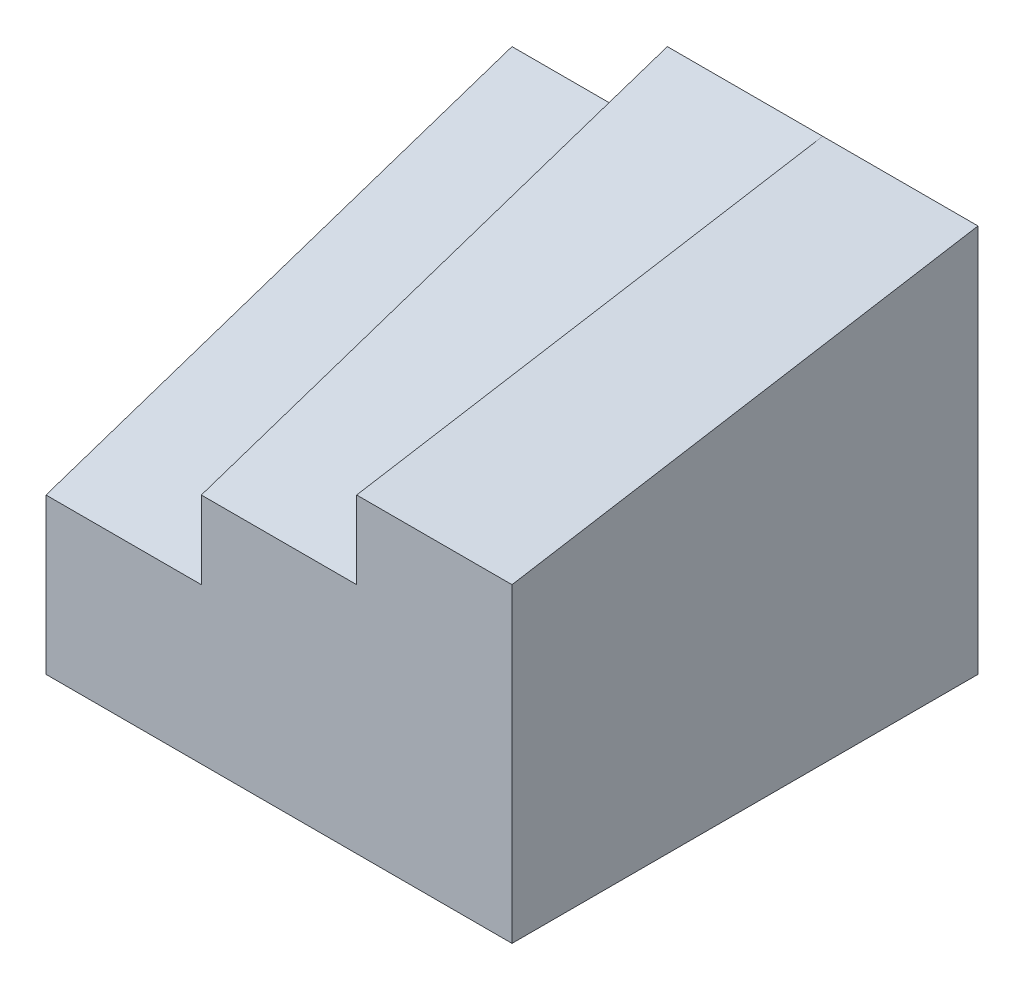
ISO-10303-21;
HEADER;
FILE_DESCRIPTION(('STEP AP214'),'2;1');
FILE_NAME('part.step','',(''),(''),'','','');
FILE_SCHEMA(('AUTOMOTIVE_DESIGN { 1 0 10303 214 1 1 1 1 }'));
ENDSEC;
DATA;
#1=APPLICATION_CONTEXT('core data for automotive mechanical design processes');
#2=APPLICATION_PROTOCOL_DEFINITION('international standard','automotive_design',2000,#1);
#3=PRODUCT_CONTEXT('',#1,'mechanical');
#4=PRODUCT('Part','Part','',(#3));
#5=PRODUCT_RELATED_PRODUCT_CATEGORY('part','',(#4));
#6=PRODUCT_DEFINITION_FORMATION('','',#4);
#7=PRODUCT_DEFINITION_CONTEXT('part definition',#1,'design');
#8=PRODUCT_DEFINITION('design','',#6,#7);
#9=PRODUCT_DEFINITION_SHAPE('','',#8);
#10=(LENGTH_UNIT() NAMED_UNIT(*) SI_UNIT(.MILLI.,.METRE.));
#11=(NAMED_UNIT(*) PLANE_ANGLE_UNIT() SI_UNIT($,.RADIAN.));
#12=(NAMED_UNIT(*) SI_UNIT($,.STERADIAN.) SOLID_ANGLE_UNIT());
#13=UNCERTAINTY_MEASURE_WITH_UNIT(LENGTH_MEASURE(1.E-05),#10,'distance_accuracy_value','');
#14=(GEOMETRIC_REPRESENTATION_CONTEXT(3) GLOBAL_UNCERTAINTY_ASSIGNED_CONTEXT((#13)) GLOBAL_UNIT_ASSIGNED_CONTEXT((#10,
#11,#12)) REPRESENTATION_CONTEXT('',''));
#15=CARTESIAN_POINT('',(0.,0.,0.));
#16=DIRECTION('',(0.,0.,1.));
#17=DIRECTION('',(1.,0.,0.));
#18=AXIS2_PLACEMENT_3D('',#15,#16,#17);
#19=CARTESIAN_POINT('',(-3.,5.,-3.));
#20=DIRECTION('',(0.,0.,1.));
#21=DIRECTION('',(1.,0.,0.));
#22=AXIS2_PLACEMENT_3D('',#19,#20,#21);
#23=PLANE('',#22);
#24=DIRECTION('',(-1.,0.,0.));
#25=VECTOR('',#24,1.);
#26=CARTESIAN_POINT('',(-1.,4.,-3.));
#27=LINE('',#26,#25);
#28=CARTESIAN_POINT('',(-1.,4.,-3.));
#29=VERTEX_POINT('',#28);
#30=CARTESIAN_POINT('',(-3.,4.,-3.));
#31=VERTEX_POINT('',#30);
#32=EDGE_CURVE('E183',#29,#31,#27,.T.);
#33=ORIENTED_EDGE('',*,*,#32,.F.);
#34=DIRECTION('',(0.,-1.,0.));
#35=VECTOR('',#34,1.);
#36=CARTESIAN_POINT('',(-1.,0.,-3.));
#37=LINE('',#36,#35);
#38=CARTESIAN_POINT('',(-1.,5.,-3.));
#39=VERTEX_POINT('',#38);
#40=EDGE_CURVE('E184',#39,#29,#37,.T.);
#41=ORIENTED_EDGE('',*,*,#40,.F.);
#42=DIRECTION('',(1.,0.,0.));
#43=VECTOR('',#42,1.);
#44=CARTESIAN_POINT('',(-1.,5.,-3.));
#45=LINE('',#44,#43);
#46=CARTESIAN_POINT('',(1.,5.,-3.));
#47=VERTEX_POINT('',#46);
#48=EDGE_CURVE('E131',#39,#47,#45,.T.);
#49=ORIENTED_EDGE('',*,*,#48,.T.);
#50=DIRECTION('',(-1.,0.,0.));
#51=VECTOR('',#50,1.);
#52=CARTESIAN_POINT('',(-3.,5.,-3.));
#53=LINE('',#52,#51);
#54=CARTESIAN_POINT('',(3.,5.,-3.));
#55=VERTEX_POINT('',#54);
#56=EDGE_CURVE('E118',#55,#47,#53,.T.);
#57=ORIENTED_EDGE('',*,*,#56,.F.);
#58=DIRECTION('',(0.,-1.,0.));
#59=VECTOR('',#58,1.);
#60=CARTESIAN_POINT('',(3.,5.,-3.));
#61=LINE('',#60,#59);
#62=CARTESIAN_POINT('',(3.,0.,-3.));
#63=VERTEX_POINT('',#62);
#64=EDGE_CURVE('E11',#55,#63,#61,.T.);
#65=ORIENTED_EDGE('',*,*,#64,.T.);
#66=DIRECTION('',(-1.,0.,0.));
#67=VECTOR('',#66,1.);
#68=CARTESIAN_POINT('',(-3.,0.,-3.));
#69=LINE('',#68,#67);
#70=CARTESIAN_POINT('',(1.,0.,-3.));
#71=VERTEX_POINT('',#70);
#72=EDGE_CURVE('E142',#63,#71,#69,.T.);
#73=ORIENTED_EDGE('',*,*,#72,.T.);
#74=DIRECTION('',(0.,1.,0.));
#75=VECTOR('',#74,1.);
#76=CARTESIAN_POINT('',(1.,1.,-3.));
#77=LINE('',#76,#75);
#78=CARTESIAN_POINT('',(1.,1.,-3.));
#79=VERTEX_POINT('',#78);
#80=EDGE_CURVE('E48',#71,#79,#77,.T.);
#81=ORIENTED_EDGE('',*,*,#80,.T.);
#82=DIRECTION('',(1.,0.,0.));
#83=VECTOR('',#82,1.);
#84=CARTESIAN_POINT('',(-1.,1.,-3.));
#85=LINE('',#84,#83);
#86=CARTESIAN_POINT('',(-1.,1.,-3.));
#87=VERTEX_POINT('',#86);
#88=EDGE_CURVE('E145',#87,#79,#85,.T.);
#89=ORIENTED_EDGE('',*,*,#88,.F.);
#90=DIRECTION('',(0.,1.,0.));
#91=VECTOR('',#90,1.);
#92=CARTESIAN_POINT('',(-1.,1.,-3.));
#93=LINE('',#92,#91);
#94=CARTESIAN_POINT('',(-1.,0.,-3.));
#95=VERTEX_POINT('',#94);
#96=EDGE_CURVE('E169',#95,#87,#93,.T.);
#97=ORIENTED_EDGE('',*,*,#96,.F.);
#98=CARTESIAN_POINT('',(-3.,0.,-3.));
#99=VERTEX_POINT('',#98);
#100=EDGE_CURVE('E138',#95,#99,#69,.T.);
#101=ORIENTED_EDGE('',*,*,#100,.T.);
#102=DIRECTION('',(0.,-1.,0.));
#103=VECTOR('',#102,1.);
#104=CARTESIAN_POINT('',(-3.,5.,-3.));
#105=LINE('',#104,#103);
#106=EDGE_CURVE('E41',#31,#99,#105,.T.);
#107=ORIENTED_EDGE('',*,*,#106,.F.);
#108=EDGE_LOOP('',(#33,#41,#49,#57,#65,#73,#81,#89,#97,#101,#107));
#109=FACE_BOUND('',#108,.T.);
#110=ADVANCED_FACE('F33',(#109),#23,.F.);
#111=CARTESIAN_POINT('',(-3.,5.,3.));
#112=DIRECTION('',(0.,0.,-1.));
#113=DIRECTION('',(-1.,0.,0.));
#114=AXIS2_PLACEMENT_3D('',#111,#112,#113);
#115=PLANE('',#114);
#116=DIRECTION('',(0.,-1.,0.));
#117=VECTOR('',#116,1.);
#118=CARTESIAN_POINT('',(3.,5.,3.));
#119=LINE('',#118,#117);
#120=CARTESIAN_POINT('',(3.,4.,3.));
#121=VERTEX_POINT('',#120);
#122=CARTESIAN_POINT('',(3.,0.,3.));
#123=VERTEX_POINT('',#122);
#124=EDGE_CURVE('E56',#121,#123,#119,.T.);
#125=ORIENTED_EDGE('',*,*,#124,.F.);
#126=DIRECTION('',(-1.,0.,0.));
#127=VECTOR('',#126,1.);
#128=CARTESIAN_POINT('',(3.,4.,3.));
#129=LINE('',#128,#127);
#130=CARTESIAN_POINT('',(1.,4.,3.));
#131=VERTEX_POINT('',#130);
#132=EDGE_CURVE('E121',#121,#131,#129,.T.);
#133=ORIENTED_EDGE('',*,*,#132,.T.);
#134=DIRECTION('',(0.,-1.,0.));
#135=VECTOR('',#134,1.);
#136=CARTESIAN_POINT('',(1.,3.,3.));
#137=LINE('',#136,#135);
#138=CARTESIAN_POINT('',(1.,3.,3.));
#139=VERTEX_POINT('',#138);
#140=EDGE_CURVE('E186',#131,#139,#137,.T.);
#141=ORIENTED_EDGE('',*,*,#140,.T.);
#142=DIRECTION('',(1.,0.,0.));
#143=VECTOR('',#142,1.);
#144=CARTESIAN_POINT('',(-1.,3.,3.));
#145=LINE('',#144,#143);
#146=CARTESIAN_POINT('',(-1.,3.,3.));
#147=VERTEX_POINT('',#146);
#148=EDGE_CURVE('E205',#147,#139,#145,.T.);
#149=ORIENTED_EDGE('',*,*,#148,.F.);
#150=DIRECTION('',(0.,1.,0.));
#151=VECTOR('',#150,1.);
#152=CARTESIAN_POINT('',(-1.,0.,3.));
#153=LINE('',#152,#151);
#154=CARTESIAN_POINT('',(-1.,2.,3.));
#155=VERTEX_POINT('',#154);
#156=EDGE_CURVE('E180',#155,#147,#153,.T.);
#157=ORIENTED_EDGE('',*,*,#156,.F.);
#158=DIRECTION('',(-1.,0.,0.));
#159=VECTOR('',#158,1.);
#160=CARTESIAN_POINT('',(-1.,2.,3.));
#161=LINE('',#160,#159);
#162=CARTESIAN_POINT('',(-3.,2.,3.));
#163=VERTEX_POINT('',#162);
#164=EDGE_CURVE('E178',#155,#163,#161,.T.);
#165=ORIENTED_EDGE('',*,*,#164,.T.);
#166=DIRECTION('',(0.,-1.,0.));
#167=VECTOR('',#166,1.);
#168=CARTESIAN_POINT('',(-3.,5.,3.));
#169=LINE('',#168,#167);
#170=CARTESIAN_POINT('',(-3.,0.,3.));
#171=VERTEX_POINT('',#170);
#172=EDGE_CURVE('E156',#163,#171,#169,.T.);
#173=ORIENTED_EDGE('',*,*,#172,.T.);
#174=DIRECTION('',(1.,0.,0.));
#175=VECTOR('',#174,1.);
#176=CARTESIAN_POINT('',(-3.,0.,3.));
#177=LINE('',#176,#175);
#178=CARTESIAN_POINT('',(-1.,0.,3.));
#179=VERTEX_POINT('',#178);
#180=EDGE_CURVE('E132',#171,#179,#177,.T.);
#181=ORIENTED_EDGE('',*,*,#180,.T.);
#182=DIRECTION('',(1.,0.,0.));
#183=VECTOR('',#182,1.);
#184=CARTESIAN_POINT('',(-1.,0.,3.));
#185=LINE('',#184,#183);
#186=CARTESIAN_POINT('',(1.,0.,3.));
#187=VERTEX_POINT('',#186);
#188=EDGE_CURVE('E139',#179,#187,#185,.T.);
#189=ORIENTED_EDGE('',*,*,#188,.T.);
#190=EDGE_CURVE('E152',#187,#123,#177,.T.);
#191=ORIENTED_EDGE('',*,*,#190,.T.);
#192=EDGE_LOOP('',(#125,#133,#141,#149,#157,#165,#173,#181,#189,#191));
#193=FACE_BOUND('',#192,.T.);
#194=ADVANCED_FACE('F175',(#193),#115,.F.);
#195=CARTESIAN_POINT('',(-3.,5.,3.));
#196=DIRECTION('',(1.,0.,0.));
#197=DIRECTION('',(0.,0.,-1.));
#198=AXIS2_PLACEMENT_3D('',#195,#196,#197);
#199=PLANE('',#198);
#200=DIRECTION('',(0.,0.316227766016838,-0.948683298050514));
#201=VECTOR('',#200,1.);
#202=CARTESIAN_POINT('',(-3.,2.7,0.9));
#203=LINE('',#202,#201);
#204=EDGE_CURVE('E164',#163,#31,#203,.T.);
#205=ORIENTED_EDGE('',*,*,#204,.T.);
#206=ORIENTED_EDGE('',*,*,#106,.T.);
#207=DIRECTION('',(0.,0.,1.));
#208=VECTOR('',#207,1.);
#209=CARTESIAN_POINT('',(-3.,0.,3.));
#210=LINE('',#209,#208);
#211=EDGE_CURVE('E149',#99,#171,#210,.T.);
#212=ORIENTED_EDGE('',*,*,#211,.T.);
#213=ORIENTED_EDGE('',*,*,#172,.F.);
#214=EDGE_LOOP('',(#205,#206,#212,#213));
#215=FACE_BOUND('',#214,.T.);
#216=ADVANCED_FACE('F160',(#215),#199,.F.);
#217=CARTESIAN_POINT('',(0.,0.,0.));
#218=DIRECTION('',(0.,-1.,0.));
#219=DIRECTION('',(0.,0.,-1.));
#220=AXIS2_PLACEMENT_3D('',#217,#218,#219);
#221=PLANE('',#220);
#222=ORIENTED_EDGE('',*,*,#100,.F.);
#223=DIRECTION('',(0.,0.,-1.));
#224=VECTOR('',#223,1.);
#225=CARTESIAN_POINT('',(-1.,0.,3.));
#226=LINE('',#225,#224);
#227=EDGE_CURVE('E173',#179,#95,#226,.T.);
#228=ORIENTED_EDGE('',*,*,#227,.F.);
#229=ORIENTED_EDGE('',*,*,#180,.F.);
#230=ORIENTED_EDGE('',*,*,#211,.F.);
#231=EDGE_LOOP('',(#222,#228,#229,#230));
#232=FACE_BOUND('',#231,.T.);
#233=ADVANCED_FACE('F172',(#232),#221,.T.);
#234=CARTESIAN_POINT('',(3.,5.,3.));
#235=DIRECTION('',(-1.,0.,0.));
#236=DIRECTION('',(0.,0.,1.));
#237=AXIS2_PLACEMENT_3D('',#234,#235,#236);
#238=PLANE('',#237);
#239=ORIENTED_EDGE('',*,*,#64,.F.);
#240=DIRECTION('',(0.,-0.164398987305357,0.986393923832144));
#241=VECTOR('',#240,1.);
#242=CARTESIAN_POINT('',(3.,4.37837837837838,0.72972972972973));
#243=LINE('',#242,#241);
#244=EDGE_CURVE('E115',#55,#121,#243,.T.);
#245=ORIENTED_EDGE('',*,*,#244,.T.);
#246=ORIENTED_EDGE('',*,*,#124,.T.);
#247=DIRECTION('',(0.,0.,-1.));
#248=VECTOR('',#247,1.);
#249=CARTESIAN_POINT('',(3.,0.,3.));
#250=LINE('',#249,#248);
#251=EDGE_CURVE('E135',#123,#63,#250,.T.);
#252=ORIENTED_EDGE('',*,*,#251,.T.);
#253=EDGE_LOOP('',(#239,#245,#246,#252));
#254=FACE_BOUND('',#253,.T.);
#255=ADVANCED_FACE('F35',(#254),#238,.F.);
#256=DIRECTION('',(0.,0.,-1.));
#257=VECTOR('',#256,1.);
#258=CARTESIAN_POINT('',(1.,0.,3.));
#259=LINE('',#258,#257);
#260=EDGE_CURVE('E194',#187,#71,#259,.T.);
#261=ORIENTED_EDGE('',*,*,#260,.T.);
#262=ORIENTED_EDGE('',*,*,#72,.F.);
#263=ORIENTED_EDGE('',*,*,#251,.F.);
#264=ORIENTED_EDGE('',*,*,#190,.F.);
#265=EDGE_LOOP('',(#261,#262,#263,#264));
#266=FACE_BOUND('',#265,.T.);
#267=ADVANCED_FACE('F243',(#266),#221,.T.);
#268=CARTESIAN_POINT('',(-1.,0.,3.));
#269=DIRECTION('',(0.,0.986393923832144,0.164398987305357));
#270=DIRECTION('',(0.,-0.164398987305357,0.986393923832144));
#271=AXIS2_PLACEMENT_3D('',#268,#269,#270);
#272=PLANE('',#271);
#273=DIRECTION('',(0.,-0.164398987305357,0.986393923832144));
#274=VECTOR('',#273,1.);
#275=CARTESIAN_POINT('',(1.,0.,3.));
#276=LINE('',#275,#274);
#277=EDGE_CURVE('E199',#79,#187,#276,.T.);
#278=ORIENTED_EDGE('',*,*,#277,.T.);
#279=ORIENTED_EDGE('',*,*,#188,.F.);
#280=DIRECTION('',(0.,-0.164398987305357,0.986393923832144));
#281=VECTOR('',#280,1.);
#282=CARTESIAN_POINT('',(-1.,0.,3.));
#283=LINE('',#282,#281);
#284=EDGE_CURVE('E193',#87,#179,#283,.T.);
#285=ORIENTED_EDGE('',*,*,#284,.F.);
#286=ORIENTED_EDGE('',*,*,#88,.T.);
#287=EDGE_LOOP('',(#278,#279,#285,#286));
#288=FACE_BOUND('',#287,.T.);
#289=ADVANCED_FACE('F246',(#288),#272,.F.);
#290=CARTESIAN_POINT('',(-1.,0.,0.));
#291=DIRECTION('',(1.,0.,0.));
#292=DIRECTION('',(0.,0.,-1.));
#293=AXIS2_PLACEMENT_3D('',#290,#291,#292);
#294=PLANE('',#293);
#295=ORIENTED_EDGE('',*,*,#96,.T.);
#296=ORIENTED_EDGE('',*,*,#284,.T.);
#297=ORIENTED_EDGE('',*,*,#227,.T.);
#298=EDGE_LOOP('',(#295,#296,#297));
#299=FACE_BOUND('',#298,.T.);
#300=ADVANCED_FACE('F254',(#299),#294,.T.);
#301=CARTESIAN_POINT('',(1.,0.,0.));
#302=DIRECTION('',(1.,0.,0.));
#303=DIRECTION('',(0.,0.,-1.));
#304=AXIS2_PLACEMENT_3D('',#301,#302,#303);
#305=PLANE('',#304);
#306=ORIENTED_EDGE('',*,*,#80,.F.);
#307=ORIENTED_EDGE('',*,*,#260,.F.);
#308=ORIENTED_EDGE('',*,*,#277,.F.);
#309=EDGE_LOOP('',(#306,#307,#308));
#310=FACE_BOUND('',#309,.T.);
#311=ADVANCED_FACE('F249',(#310),#305,.F.);
#312=CARTESIAN_POINT('',(-1.,5.,-3.));
#313=DIRECTION('',(0.,-0.948683298050514,-0.316227766016838));
#314=DIRECTION('',(0.,0.316227766016838,-0.948683298050514));
#315=AXIS2_PLACEMENT_3D('',#312,#313,#314);
#316=PLANE('',#315);
#317=DIRECTION('',(0.,0.316227766016838,-0.948683298050514));
#318=VECTOR('',#317,1.);
#319=CARTESIAN_POINT('',(1.,5.,-3.));
#320=LINE('',#319,#318);
#321=EDGE_CURVE('E206',#139,#47,#320,.T.);
#322=ORIENTED_EDGE('',*,*,#321,.T.);
#323=ORIENTED_EDGE('',*,*,#48,.F.);
#324=DIRECTION('',(0.,0.316227766016838,-0.948683298050514));
#325=VECTOR('',#324,1.);
#326=CARTESIAN_POINT('',(-1.,5.,-3.));
#327=LINE('',#326,#325);
#328=EDGE_CURVE('E203',#147,#39,#327,.T.);
#329=ORIENTED_EDGE('',*,*,#328,.F.);
#330=ORIENTED_EDGE('',*,*,#148,.T.);
#331=EDGE_LOOP('',(#322,#323,#329,#330));
#332=FACE_BOUND('',#331,.T.);
#333=ADVANCED_FACE('F214',(#332),#316,.F.);
#334=CARTESIAN_POINT('',(1.,0.,0.));
#335=DIRECTION('',(1.,0.,0.));
#336=DIRECTION('',(0.,0.,-1.));
#337=AXIS2_PLACEMENT_3D('',#334,#335,#336);
#338=PLANE('',#337);
#339=ORIENTED_EDGE('',*,*,#140,.F.);
#340=DIRECTION('',(0.,-0.164398987305357,0.986393923832144));
#341=VECTOR('',#340,1.);
#342=CARTESIAN_POINT('',(1.,4.37837837837838,0.72972972972973));
#343=LINE('',#342,#341);
#344=EDGE_CURVE('E123',#47,#131,#343,.T.);
#345=ORIENTED_EDGE('',*,*,#344,.F.);
#346=ORIENTED_EDGE('',*,*,#321,.F.);
#347=EDGE_LOOP('',(#339,#345,#346));
#348=FACE_BOUND('',#347,.T.);
#349=ADVANCED_FACE('F217',(#348),#338,.F.);
#350=CARTESIAN_POINT('',(-1.,0.,0.));
#351=DIRECTION('',(-1.,0.,0.));
#352=DIRECTION('',(0.,0.,1.));
#353=AXIS2_PLACEMENT_3D('',#350,#351,#352);
#354=PLANE('',#353);
#355=ORIENTED_EDGE('',*,*,#328,.T.);
#356=ORIENTED_EDGE('',*,*,#40,.T.);
#357=DIRECTION('',(0.,0.316227766016838,-0.948683298050514));
#358=VECTOR('',#357,1.);
#359=CARTESIAN_POINT('',(-1.,2.7,0.9));
#360=LINE('',#359,#358);
#361=EDGE_CURVE('E221',#155,#29,#360,.T.);
#362=ORIENTED_EDGE('',*,*,#361,.F.);
#363=ORIENTED_EDGE('',*,*,#156,.T.);
#364=EDGE_LOOP('',(#355,#356,#362,#363));
#365=FACE_BOUND('',#364,.T.);
#366=ADVANCED_FACE('F224',(#365),#354,.T.);
#367=CARTESIAN_POINT('',(-1.,2.7,0.9));
#368=DIRECTION('',(0.,0.948683298050514,0.316227766016838));
#369=DIRECTION('',(0.,-0.316227766016838,0.948683298050514));
#370=AXIS2_PLACEMENT_3D('',#367,#368,#369);
#371=PLANE('',#370);
#372=ORIENTED_EDGE('',*,*,#204,.F.);
#373=ORIENTED_EDGE('',*,*,#164,.F.);
#374=ORIENTED_EDGE('',*,*,#361,.T.);
#375=ORIENTED_EDGE('',*,*,#32,.T.);
#376=EDGE_LOOP('',(#372,#373,#374,#375));
#377=FACE_BOUND('',#376,.T.);
#378=ADVANCED_FACE('F225',(#377),#371,.T.);
#379=CARTESIAN_POINT('',(3.,4.37837837837838,0.72972972972973));
#380=DIRECTION('',(0.,-0.986393923832144,-0.164398987305357));
#381=DIRECTION('',(0.,0.164398987305357,-0.986393923832144));
#382=AXIS2_PLACEMENT_3D('',#379,#380,#381);
#383=PLANE('',#382);
#384=ORIENTED_EDGE('',*,*,#344,.T.);
#385=ORIENTED_EDGE('',*,*,#132,.F.);
#386=ORIENTED_EDGE('',*,*,#244,.F.);
#387=ORIENTED_EDGE('',*,*,#56,.T.);
#388=EDGE_LOOP('',(#384,#385,#386,#387));
#389=FACE_BOUND('',#388,.T.);
#390=ADVANCED_FACE('F117',(#389),#383,.F.);
#391=CLOSED_SHELL('',(#110,#194,#216,#233,#255,#267,#289,#300,#311,#333,#349,#366,#378,#390));
#392=MANIFOLD_SOLID_BREP('B2',#391);
#393=ADVANCED_BREP_SHAPE_REPRESENTATION('',(#18,#392),#14);
#394=SHAPE_DEFINITION_REPRESENTATION(#9,#393);
ENDSEC;
END-ISO-10303-21;
